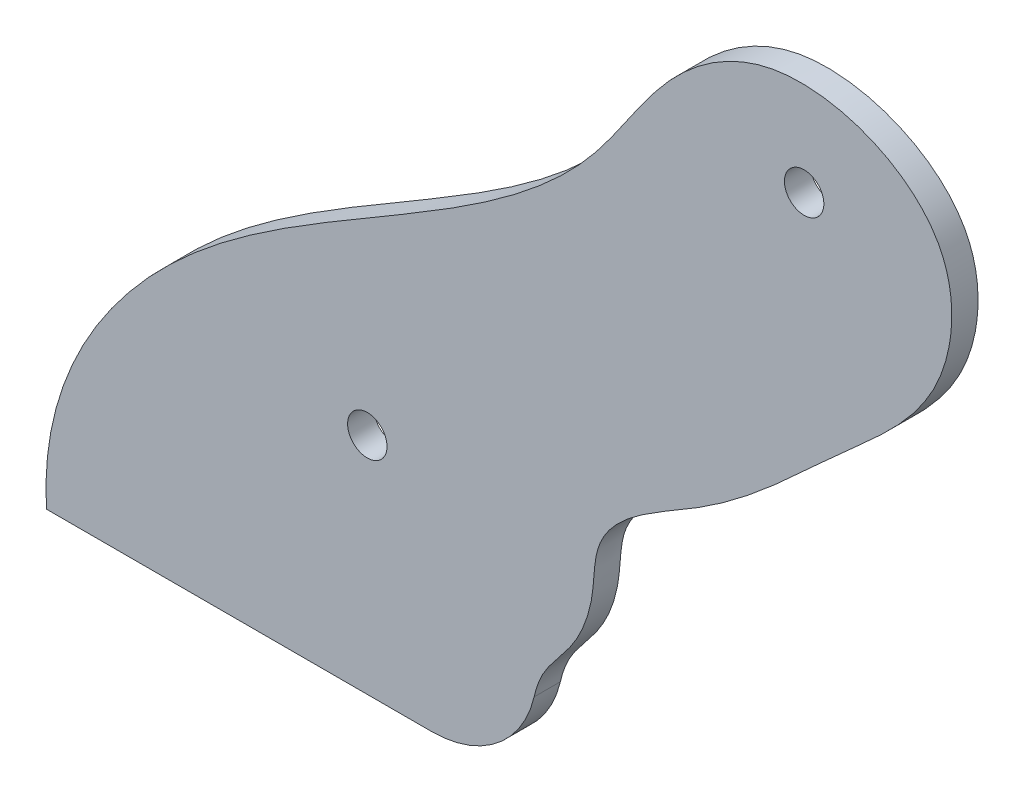
ISO-10303-21;
HEADER;
FILE_DESCRIPTION(('STEP AP214'),'2;1');
FILE_NAME('part.step','',(''),(''),'','','');
FILE_SCHEMA(('AUTOMOTIVE_DESIGN { 1 0 10303 214 1 1 1 1 }'));
ENDSEC;
DATA;
#1=APPLICATION_CONTEXT('core data for automotive mechanical design processes');
#2=APPLICATION_PROTOCOL_DEFINITION('international standard','automotive_design',2000,#1);
#3=PRODUCT_CONTEXT('',#1,'mechanical');
#4=PRODUCT('Part','Part','',(#3));
#5=PRODUCT_RELATED_PRODUCT_CATEGORY('part','',(#4));
#6=PRODUCT_DEFINITION_FORMATION('','',#4);
#7=PRODUCT_DEFINITION_CONTEXT('part definition',#1,'design');
#8=PRODUCT_DEFINITION('design','',#6,#7);
#9=PRODUCT_DEFINITION_SHAPE('','',#8);
#10=(LENGTH_UNIT() NAMED_UNIT(*) SI_UNIT(.MILLI.,.METRE.));
#11=(NAMED_UNIT(*) PLANE_ANGLE_UNIT() SI_UNIT($,.RADIAN.));
#12=(NAMED_UNIT(*) SI_UNIT($,.STERADIAN.) SOLID_ANGLE_UNIT());
#13=UNCERTAINTY_MEASURE_WITH_UNIT(LENGTH_MEASURE(1.E-05),#10,'distance_accuracy_value','');
#14=(GEOMETRIC_REPRESENTATION_CONTEXT(3) GLOBAL_UNCERTAINTY_ASSIGNED_CONTEXT((#13)) GLOBAL_UNIT_ASSIGNED_CONTEXT((#10,
#11,#12)) REPRESENTATION_CONTEXT('',''));
#15=CARTESIAN_POINT('',(0.,0.,0.));
#16=DIRECTION('',(0.,0.,1.));
#17=DIRECTION('',(1.,0.,0.));
#18=AXIS2_PLACEMENT_3D('',#15,#16,#17);
#19=CARTESIAN_POINT('',(445.010460863422,107.598235274084,3.175));
#20=DIRECTION('',(0.,0.,1.));
#21=DIRECTION('',(1.,0.,0.));
#22=AXIS2_PLACEMENT_3D('',#19,#20,#21);
#23=PLANE('',#22);
#24=CARTESIAN_POINT('',(399.404302930045,45.7753435408592,3.175));
#25=DIRECTION('',(0.,0.,1.));
#26=DIRECTION('',(1.,0.,0.));
#27=AXIS2_PLACEMENT_3D('',#24,#25,#26);
#28=CIRCLE('',#27,2.38125);
#29=CARTESIAN_POINT('',(401.785552930045,45.7753435408592,3.175));
#30=VERTEX_POINT('',#29);
#31=EDGE_CURVE('E155',#30,#30,#28,.T.);
#32=ORIENTED_EDGE('',*,*,#31,.F.);
#33=EDGE_LOOP('',(#32));
#34=FACE_BOUND('',#33,.T.);
#35=DIRECTION('',(-1.,0.,0.));
#36=VECTOR('',#35,1.);
#37=CARTESIAN_POINT('',(417.546081306226,18.65895103945,3.175));
#38=LINE('',#37,#36);
#39=CARTESIAN_POINT('',(407.181705030025,18.65895103945,3.175));
#40=VERTEX_POINT('',#39);
#41=CARTESIAN_POINT('',(360.644130568892,18.65895103945,3.175));
#42=VERTEX_POINT('',#41);
#43=EDGE_CURVE('E92',#40,#42,#38,.T.);
#44=ORIENTED_EDGE('',*,*,#43,.F.);
#45=CARTESIAN_POINT('',(407.181705030025,31.3589510394501,3.175));
#46=DIRECTION('',(0.,0.,1.));
#47=DIRECTION('',(1.,0.,0.));
#48=AXIS2_PLACEMENT_3D('',#45,#46,#47);
#49=CIRCLE('',#48,12.7);
#50=CARTESIAN_POINT('',(419.550020030887,28.4754143153102,3.175));
#51=VERTEX_POINT('',#50);
#52=EDGE_CURVE('E12',#40,#51,#49,.T.);
#53=ORIENTED_EDGE('',*,*,#52,.T.);
#54=CARTESIAN_POINT('',(360.644130568892,18.65895103945,3.175));
#55=CARTESIAN_POINT('',(359.838395400763,32.3250581101448,3.175));
#56=CARTESIAN_POINT('',(373.162837365058,53.4956912574402,3.175));
#57=CARTESIAN_POINT('',(402.403655016687,70.0612863736529,3.175));
#58=CARTESIAN_POINT('',(425.11534127429,83.9570660519803,3.175));
#59=CARTESIAN_POINT('',(435.168216309106,102.155706872171,3.175));
#60=CARTESIAN_POINT('',(450.412839390622,112.167568554,3.175));
#61=CARTESIAN_POINT('',(471.32260991079,103.875507849788,3.175));
#62=CARTESIAN_POINT('',(469.702927035437,83.4452088091783,3.175));
#63=CARTESIAN_POINT('',(454.962785943321,71.5616101116504,3.175));
#64=CARTESIAN_POINT('',(442.645833335382,58.7735017928705,3.175));
#65=CARTESIAN_POINT('',(426.712648336961,51.6623192249354,3.175));
#66=CARTESIAN_POINT('',(426.83700418,41.7868598691445,3.175));
#67=CARTESIAN_POINT('',(424.606227179343,36.0701002811815,3.175));
#68=CARTESIAN_POINT('',(418.230705296807,29.8094244719602,3.175));
#69=CARTESIAN_POINT('',(419.314069357834,22.1393125178839,3.175));
#70=CARTESIAN_POINT('',(417.546081306226,18.65895103945,3.175));
#71=B_SPLINE_CURVE_WITH_KNOTS('',3,(#54,#55,#56,#57,#58,#59,#60,#61,#62,#63,#64,#65,#66,#67,#68,
#69,#70),.UNSPECIFIED.,.F.,.F.,(4,1,1,1,1,1,1,1,1,1,1,1,1,1,4),(0.,0.153616330959951,
0.274148566785296,0.398594080606763,0.457961643213161,0.516431911428125,0.60143332526425,
0.654877322773361,0.72558207101255,0.814973140929685,0.878081725634951,0.897227189299792,
0.926552601957028,0.948638611931483,1.),.UNSPECIFIED.);
#72=EDGE_CURVE('E100',#42,#51,#71,.T.);
#73=ORIENTED_EDGE('',*,*,#72,.F.);
#74=EDGE_LOOP('',(#44,#53,#73));
#75=FACE_BOUND('',#74,.T.);
#76=CARTESIAN_POINT('',(452.168961384498,97.5389039134258,3.175));
#77=DIRECTION('',(0.,0.,1.));
#78=DIRECTION('',(1.,0.,0.));
#79=AXIS2_PLACEMENT_3D('',#76,#77,#78);
#80=CIRCLE('',#79,2.38125);
#81=CARTESIAN_POINT('',(454.550211384498,97.5389039134258,3.175));
#82=VERTEX_POINT('',#81);
#83=EDGE_CURVE('E148',#82,#82,#80,.T.);
#84=ORIENTED_EDGE('',*,*,#83,.F.);
#85=EDGE_LOOP('',(#84));
#86=FACE_BOUND('',#85,.T.);
#87=ADVANCED_FACE('F61',(#34,#75,#86),#23,.T.);
#88=CARTESIAN_POINT('',(445.010460863422,107.598235274084,0.));
#89=DIRECTION('',(0.,0.,1.));
#90=DIRECTION('',(1.,0.,0.));
#91=AXIS2_PLACEMENT_3D('',#88,#89,#90);
#92=PLANE('',#91);
#93=CARTESIAN_POINT('',(360.644130568892,18.65895103945,0.));
#94=CARTESIAN_POINT('',(359.838395400763,32.3250581101448,0.));
#95=CARTESIAN_POINT('',(373.162837365058,53.4956912574402,0.));
#96=CARTESIAN_POINT('',(402.403655016687,70.0612863736529,0.));
#97=CARTESIAN_POINT('',(425.11534127429,83.9570660519803,0.));
#98=CARTESIAN_POINT('',(435.168216309106,102.155706872171,0.));
#99=CARTESIAN_POINT('',(450.412839390622,112.167568554,0.));
#100=CARTESIAN_POINT('',(471.32260991079,103.875507849788,0.));
#101=CARTESIAN_POINT('',(469.702927035437,83.4452088091783,0.));
#102=CARTESIAN_POINT('',(454.962785943321,71.5616101116504,0.));
#103=CARTESIAN_POINT('',(442.645833335382,58.7735017928705,0.));
#104=CARTESIAN_POINT('',(426.712648336961,51.6623192249354,0.));
#105=CARTESIAN_POINT('',(426.83700418,41.7868598691445,0.));
#106=CARTESIAN_POINT('',(424.606227179343,36.0701002811815,0.));
#107=CARTESIAN_POINT('',(418.230705296807,29.8094244719602,0.));
#108=CARTESIAN_POINT('',(419.314069357834,22.1393125178839,0.));
#109=CARTESIAN_POINT('',(417.546081306226,18.65895103945,0.));
#110=B_SPLINE_CURVE_WITH_KNOTS('',3,(#93,#94,#95,#96,#97,#98,#99,#100,#101,#102,#103,#104,#105,
#106,#107,#108,#109),.UNSPECIFIED.,.F.,.F.,(4,1,1,1,1,1,1,1,1,1,1,1,1,1,4),(0.,
0.153616330959951,0.274148566785296,0.398594080606763,0.457961643213161,0.516431911428125,
0.60143332526425,0.654877322773361,0.72558207101255,0.814973140929685,0.878081725634951,
0.897227189299792,0.926552601957028,0.948638611931483,1.),.UNSPECIFIED.);
#111=CARTESIAN_POINT('',(360.644130568892,18.65895103945,0.));
#112=VERTEX_POINT('',#111);
#113=CARTESIAN_POINT('',(419.550020030887,28.4754143153102,0.));
#114=VERTEX_POINT('',#113);
#115=EDGE_CURVE('E107',#112,#114,#110,.T.);
#116=ORIENTED_EDGE('',*,*,#115,.T.);
#117=CARTESIAN_POINT('',(407.181705030025,31.3589510394501,0.));
#118=DIRECTION('',(0.,0.,1.));
#119=DIRECTION('',(1.,0.,0.));
#120=AXIS2_PLACEMENT_3D('',#117,#118,#119);
#121=CIRCLE('',#120,12.7);
#122=CARTESIAN_POINT('',(407.181705030025,18.65895103945,0.));
#123=VERTEX_POINT('',#122);
#124=EDGE_CURVE('E83',#114,#123,#121,.F.);
#125=ORIENTED_EDGE('',*,*,#124,.T.);
#126=DIRECTION('',(-1.,0.,0.));
#127=VECTOR('',#126,1.);
#128=CARTESIAN_POINT('',(417.546081306226,18.65895103945,0.));
#129=LINE('',#128,#127);
#130=EDGE_CURVE('E111',#123,#112,#129,.T.);
#131=ORIENTED_EDGE('',*,*,#130,.T.);
#132=EDGE_LOOP('',(#116,#125,#131));
#133=FACE_BOUND('',#132,.T.);
#134=CARTESIAN_POINT('',(399.404302930045,45.7753435408592,0.));
#135=DIRECTION('',(0.,0.,1.));
#136=DIRECTION('',(1.,0.,0.));
#137=AXIS2_PLACEMENT_3D('',#134,#135,#136);
#138=CIRCLE('',#137,2.38125);
#139=CARTESIAN_POINT('',(401.785552930045,45.7753435408592,0.));
#140=VERTEX_POINT('',#139);
#141=EDGE_CURVE('E118',#140,#140,#138,.T.);
#142=ORIENTED_EDGE('',*,*,#141,.T.);
#143=EDGE_LOOP('',(#142));
#144=FACE_BOUND('',#143,.T.);
#145=CARTESIAN_POINT('',(452.168961384498,97.5389039134258,0.));
#146=DIRECTION('',(0.,0.,1.));
#147=DIRECTION('',(1.,0.,0.));
#148=AXIS2_PLACEMENT_3D('',#145,#146,#147);
#149=CIRCLE('',#148,2.38125);
#150=CARTESIAN_POINT('',(454.550211384498,97.5389039134258,0.));
#151=VERTEX_POINT('',#150);
#152=EDGE_CURVE('E151',#151,#151,#149,.T.);
#153=ORIENTED_EDGE('',*,*,#152,.T.);
#154=EDGE_LOOP('',(#153));
#155=FACE_BOUND('',#154,.T.);
#156=ADVANCED_FACE('F126',(#133,#144,#155),#92,.F.);
#157=DIRECTION('',(0.,0.,-1.));
#158=VECTOR('',#157,1.);
#159=SURFACE_OF_LINEAR_EXTRUSION('',#71,#158);
#160=ORIENTED_EDGE('',*,*,#72,.T.);
#161=DIRECTION('',(0.,0.,-1.));
#162=VECTOR('',#161,1.);
#163=CARTESIAN_POINT('',(419.550020030887,28.4754143153102,3.175));
#164=LINE('',#163,#162);
#165=EDGE_CURVE('E108',#51,#114,#164,.T.);
#166=ORIENTED_EDGE('',*,*,#165,.T.);
#167=ORIENTED_EDGE('',*,*,#115,.F.);
#168=DIRECTION('',(0.,0.,-1.));
#169=VECTOR('',#168,1.);
#170=CARTESIAN_POINT('',(360.644130568892,18.65895103945,3.175));
#171=LINE('',#170,#169);
#172=EDGE_CURVE('E95',#42,#112,#171,.T.);
#173=ORIENTED_EDGE('',*,*,#172,.F.);
#174=EDGE_LOOP('',(#160,#166,#167,#173));
#175=FACE_BOUND('',#174,.T.);
#176=ADVANCED_FACE('F104',(#175),#159,.T.);
#177=CARTESIAN_POINT('',(417.546081306226,18.65895103945,3.175));
#178=DIRECTION('',(0.,-1.,0.));
#179=DIRECTION('',(0.,0.,-1.));
#180=AXIS2_PLACEMENT_3D('',#177,#178,#179);
#181=PLANE('',#180);
#182=ORIENTED_EDGE('',*,*,#130,.F.);
#183=DIRECTION('',(0.,0.,-1.));
#184=VECTOR('',#183,1.);
#185=CARTESIAN_POINT('',(407.181705030025,18.65895103945,3.175));
#186=LINE('',#185,#184);
#187=EDGE_CURVE('E69',#123,#40,#186,.F.);
#188=ORIENTED_EDGE('',*,*,#187,.T.);
#189=ORIENTED_EDGE('',*,*,#43,.T.);
#190=ORIENTED_EDGE('',*,*,#172,.T.);
#191=EDGE_LOOP('',(#182,#188,#189,#190));
#192=FACE_BOUND('',#191,.T.);
#193=ADVANCED_FACE('F94',(#192),#181,.T.);
#194=CARTESIAN_POINT('',(399.404302930045,45.7753435408592,3.175));
#195=DIRECTION('',(0.,0.,-1.));
#196=DIRECTION('',(-1.,0.,0.));
#197=AXIS2_PLACEMENT_3D('',#194,#195,#196);
#198=CYLINDRICAL_SURFACE('',#197,2.38125);
#199=ORIENTED_EDGE('',*,*,#31,.T.);
#200=EDGE_LOOP('',(#199));
#201=FACE_BOUND('',#200,.T.);
#202=ORIENTED_EDGE('',*,*,#141,.F.);
#203=EDGE_LOOP('',(#202));
#204=FACE_BOUND('',#203,.T.);
#205=ADVANCED_FACE('F129',(#201,#204),#198,.F.);
#206=CARTESIAN_POINT('',(452.168961384498,97.5389039134258,3.175));
#207=DIRECTION('',(0.,0.,-1.));
#208=DIRECTION('',(-1.,0.,0.));
#209=AXIS2_PLACEMENT_3D('',#206,#207,#208);
#210=CYLINDRICAL_SURFACE('',#209,2.38125);
#211=ORIENTED_EDGE('',*,*,#83,.T.);
#212=EDGE_LOOP('',(#211));
#213=FACE_BOUND('',#212,.T.);
#214=ORIENTED_EDGE('',*,*,#152,.F.);
#215=EDGE_LOOP('',(#214));
#216=FACE_BOUND('',#215,.T.);
#217=ADVANCED_FACE('F137',(#213,#216),#210,.F.);
#218=CARTESIAN_POINT('',(407.181705030025,31.3589510394501,1.5875));
#219=DIRECTION('',(0.,0.,-1.));
#220=DIRECTION('',(-1.,0.,0.));
#221=AXIS2_PLACEMENT_3D('',#218,#219,#220);
#222=CYLINDRICAL_SURFACE('',#221,12.7);
#223=ORIENTED_EDGE('',*,*,#52,.F.);
#224=ORIENTED_EDGE('',*,*,#187,.F.);
#225=ORIENTED_EDGE('',*,*,#124,.F.);
#226=ORIENTED_EDGE('',*,*,#165,.F.);
#227=EDGE_LOOP('',(#223,#224,#225,#226));
#228=FACE_BOUND('',#227,.T.);
#229=ADVANCED_FACE('F63',(#228),#222,.T.);
#230=CLOSED_SHELL('',(#87,#156,#176,#193,#205,#217,#229));
#231=MANIFOLD_SOLID_BREP('B2',#230);
#232=ADVANCED_BREP_SHAPE_REPRESENTATION('',(#18,#231),#14);
#233=SHAPE_DEFINITION_REPRESENTATION(#9,#232);
ENDSEC;
END-ISO-10303-21;
